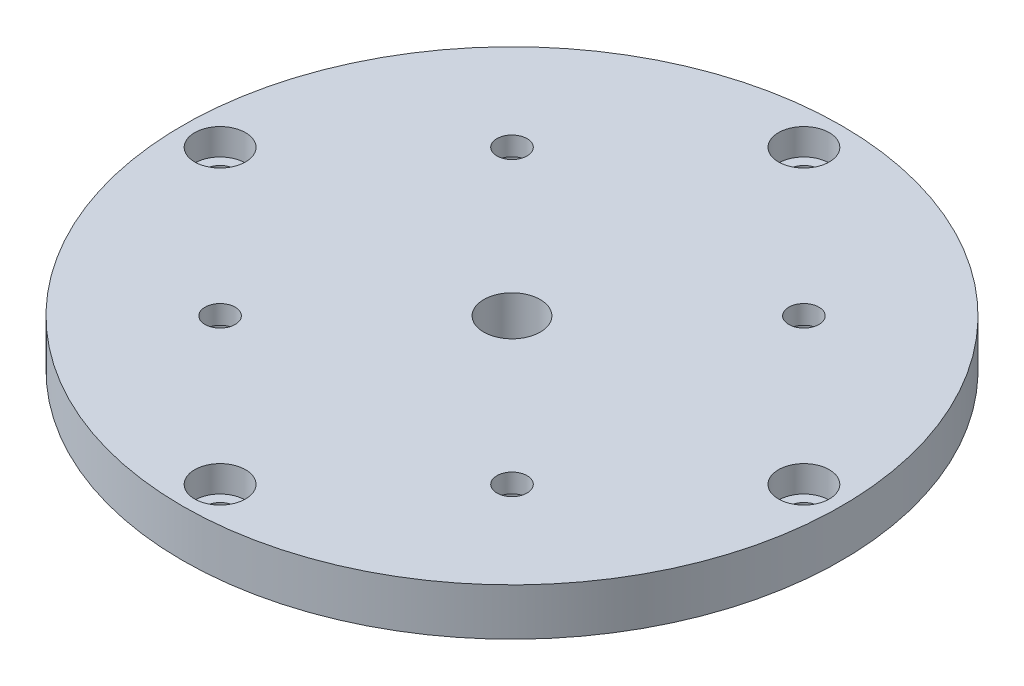
ISO-10303-21;
HEADER;
FILE_DESCRIPTION(('STEP AP214'),'2;1');
FILE_NAME('part.step','',(''),(''),'','','');
FILE_SCHEMA(('AUTOMOTIVE_DESIGN { 1 0 10303 214 1 1 1 1 }'));
ENDSEC;
DATA;
#1=APPLICATION_CONTEXT('core data for automotive mechanical design processes');
#2=APPLICATION_PROTOCOL_DEFINITION('international standard','automotive_design',2000,#1);
#3=PRODUCT_CONTEXT('',#1,'mechanical');
#4=PRODUCT('Part','Part','',(#3));
#5=PRODUCT_RELATED_PRODUCT_CATEGORY('part','',(#4));
#6=PRODUCT_DEFINITION_FORMATION('','',#4);
#7=PRODUCT_DEFINITION_CONTEXT('part definition',#1,'design');
#8=PRODUCT_DEFINITION('design','',#6,#7);
#9=PRODUCT_DEFINITION_SHAPE('','',#8);
#10=(LENGTH_UNIT() NAMED_UNIT(*) SI_UNIT(.MILLI.,.METRE.));
#11=(NAMED_UNIT(*) PLANE_ANGLE_UNIT() SI_UNIT($,.RADIAN.));
#12=(NAMED_UNIT(*) SI_UNIT($,.STERADIAN.) SOLID_ANGLE_UNIT());
#13=UNCERTAINTY_MEASURE_WITH_UNIT(LENGTH_MEASURE(1.E-05),#10,'distance_accuracy_value','');
#14=(GEOMETRIC_REPRESENTATION_CONTEXT(3) GLOBAL_UNCERTAINTY_ASSIGNED_CONTEXT((#13)) GLOBAL_UNIT_ASSIGNED_CONTEXT((#10,
#11,#12)) REPRESENTATION_CONTEXT('',''));
#15=CARTESIAN_POINT('',(0.,0.,0.));
#16=DIRECTION('',(0.,0.,1.));
#17=DIRECTION('',(1.,0.,0.));
#18=AXIS2_PLACEMENT_3D('',#15,#16,#17);
#19=CARTESIAN_POINT('',(1.75075676945298E-12,-5.,31.));
#20=DIRECTION('',(0.,1.,0.));
#21=DIRECTION('',(0.,0.,1.));
#22=AXIS2_PLACEMENT_3D('',#19,#20,#21);
#23=CYLINDRICAL_SURFACE('',#22,1.60000000000188);
#24=CARTESIAN_POINT('',(1.75075676945298E-12,0.,31.));
#25=DIRECTION('',(0.,1.,0.));
#26=DIRECTION('',(0.,0.,1.));
#27=AXIS2_PLACEMENT_3D('',#24,#25,#26);
#28=CIRCLE('',#27,1.60000000000188);
#29=CARTESIAN_POINT('',(1.75075676945298E-12,0.,32.6000000000019));
#30=VERTEX_POINT('',#29);
#31=EDGE_CURVE('E60',#30,#30,#28,.T.);
#32=ORIENTED_EDGE('',*,*,#31,.F.);
#33=EDGE_LOOP('',(#32));
#34=FACE_BOUND('',#33,.T.);
#35=CARTESIAN_POINT('',(1.75075676945298E-12,2.2,31.));
#36=DIRECTION('',(0.,1.,0.));
#37=DIRECTION('',(0.,0.,1.));
#38=AXIS2_PLACEMENT_3D('',#35,#36,#37);
#39=CIRCLE('',#38,1.60000000000188);
#40=CARTESIAN_POINT('',(1.75075676945298E-12,2.2,32.6000000000019));
#41=VERTEX_POINT('',#40);
#42=EDGE_CURVE('E45',#41,#41,#39,.F.);
#43=ORIENTED_EDGE('',*,*,#42,.F.);
#44=EDGE_LOOP('',(#43));
#45=FACE_BOUND('',#44,.T.);
#46=ADVANCED_FACE('F41',(#34,#45),#23,.F.);
#47=CARTESIAN_POINT('',(-30.9999999999991,-5.,8.79174789803846E-13));
#48=DIRECTION('',(0.,1.,0.));
#49=DIRECTION('',(0.,0.,1.));
#50=AXIS2_PLACEMENT_3D('',#47,#48,#49);
#51=CYLINDRICAL_SURFACE('',#50,1.60000000000141);
#52=CARTESIAN_POINT('',(-30.9999999999991,0.,8.79174789803846E-13));
#53=DIRECTION('',(0.,1.,0.));
#54=DIRECTION('',(0.,0.,1.));
#55=AXIS2_PLACEMENT_3D('',#52,#53,#54);
#56=CIRCLE('',#55,1.60000000000141);
#57=CARTESIAN_POINT('',(-30.9999999999991,0.,1.60000000000229));
#58=VERTEX_POINT('',#57);
#59=EDGE_CURVE('E63',#58,#58,#56,.T.);
#60=ORIENTED_EDGE('',*,*,#59,.F.);
#61=EDGE_LOOP('',(#60));
#62=FACE_BOUND('',#61,.T.);
#63=CARTESIAN_POINT('',(-30.9999999999991,2.2,8.79174789803846E-13));
#64=DIRECTION('',(0.,1.,0.));
#65=DIRECTION('',(0.,0.,1.));
#66=AXIS2_PLACEMENT_3D('',#63,#64,#65);
#67=CIRCLE('',#66,1.60000000000141);
#68=CARTESIAN_POINT('',(-30.9999999999991,2.2,1.60000000000229));
#69=VERTEX_POINT('',#68);
#70=EDGE_CURVE('E79',#69,#69,#67,.F.);
#71=ORIENTED_EDGE('',*,*,#70,.F.);
#72=EDGE_LOOP('',(#71));
#73=FACE_BOUND('',#72,.T.);
#74=ADVANCED_FACE('F89',(#62,#73),#51,.F.);
#75=CARTESIAN_POINT('',(31.0000000000009,-5.,-8.75378384726489E-13));
#76=DIRECTION('',(0.,1.,0.));
#77=DIRECTION('',(0.,0.,1.));
#78=AXIS2_PLACEMENT_3D('',#75,#76,#77);
#79=CYLINDRICAL_SURFACE('',#78,1.60000000000068);
#80=CARTESIAN_POINT('',(31.0000000000009,0.,-8.75378384726489E-13));
#81=DIRECTION('',(0.,1.,0.));
#82=DIRECTION('',(0.,0.,1.));
#83=AXIS2_PLACEMENT_3D('',#80,#81,#82);
#84=CIRCLE('',#83,1.60000000000068);
#85=CARTESIAN_POINT('',(31.0000000000009,0.,1.59999999999981));
#86=VERTEX_POINT('',#85);
#87=EDGE_CURVE('E66',#86,#86,#84,.T.);
#88=ORIENTED_EDGE('',*,*,#87,.F.);
#89=EDGE_LOOP('',(#88));
#90=FACE_BOUND('',#89,.T.);
#91=CARTESIAN_POINT('',(31.0000000000009,2.2,-8.75378384726489E-13));
#92=DIRECTION('',(0.,1.,0.));
#93=DIRECTION('',(0.,0.,1.));
#94=AXIS2_PLACEMENT_3D('',#91,#92,#93);
#95=CIRCLE('',#94,1.60000000000068);
#96=CARTESIAN_POINT('',(31.0000000000009,2.2,1.59999999999981));
#97=VERTEX_POINT('',#96);
#98=EDGE_CURVE('E76',#97,#97,#95,.F.);
#99=ORIENTED_EDGE('',*,*,#98,.F.);
#100=EDGE_LOOP('',(#99));
#101=FACE_BOUND('',#100,.T.);
#102=ADVANCED_FACE('F96',(#90,#101),#79,.F.);
#103=CARTESIAN_POINT('',(0.,-5.,-31.));
#104=DIRECTION('',(0.,1.,0.));
#105=DIRECTION('',(0.,0.,1.));
#106=AXIS2_PLACEMENT_3D('',#103,#104,#105);
#107=CYLINDRICAL_SURFACE('',#106,1.6);
#108=CARTESIAN_POINT('',(0.,0.,-31.));
#109=DIRECTION('',(0.,1.,0.));
#110=DIRECTION('',(0.,0.,1.));
#111=AXIS2_PLACEMENT_3D('',#108,#109,#110);
#112=CIRCLE('',#111,1.6);
#113=CARTESIAN_POINT('',(0.,0.,-29.4));
#114=VERTEX_POINT('',#113);
#115=EDGE_CURVE('E69',#114,#114,#112,.T.);
#116=ORIENTED_EDGE('',*,*,#115,.F.);
#117=EDGE_LOOP('',(#116));
#118=FACE_BOUND('',#117,.T.);
#119=CARTESIAN_POINT('',(0.,2.2,-31.));
#120=DIRECTION('',(0.,1.,0.));
#121=DIRECTION('',(0.,0.,1.));
#122=AXIS2_PLACEMENT_3D('',#119,#120,#121);
#123=CIRCLE('',#122,1.6);
#124=CARTESIAN_POINT('',(0.,2.2,-29.4));
#125=VERTEX_POINT('',#124);
#126=EDGE_CURVE('E73',#125,#125,#123,.F.);
#127=ORIENTED_EDGE('',*,*,#126,.F.);
#128=EDGE_LOOP('',(#127));
#129=FACE_BOUND('',#128,.T.);
#130=ADVANCED_FACE('F152',(#118,#129),#107,.F.);
#131=CARTESIAN_POINT('',(-15.5,5.,15.4999999999991));
#132=DIRECTION('',(0.,-1.,0.));
#133=DIRECTION('',(0.,0.,-1.));
#134=AXIS2_PLACEMENT_3D('',#131,#132,#133);
#135=CYLINDRICAL_SURFACE('',#134,1.60000000000094);
#136=CARTESIAN_POINT('',(-15.5,5.,15.4999999999991));
#137=DIRECTION('',(0.,-1.,0.));
#138=DIRECTION('',(0.,0.,-1.));
#139=AXIS2_PLACEMENT_3D('',#136,#137,#138);
#140=CIRCLE('',#139,1.60000000000094);
#141=CARTESIAN_POINT('',(-15.5,5.,13.8999999999982));
#142=VERTEX_POINT('',#141);
#143=EDGE_CURVE('E194',#142,#142,#140,.T.);
#144=ORIENTED_EDGE('',*,*,#143,.F.);
#145=EDGE_LOOP('',(#144));
#146=FACE_BOUND('',#145,.T.);
#147=CARTESIAN_POINT('',(-15.5,3.,15.4999999999991));
#148=DIRECTION('',(0.,-1.,0.));
#149=DIRECTION('',(0.,0.,-1.));
#150=AXIS2_PLACEMENT_3D('',#147,#148,#149);
#151=CIRCLE('',#150,1.60000000000094);
#152=CARTESIAN_POINT('',(-15.5,3.,13.8999999999982));
#153=VERTEX_POINT('',#152);
#154=EDGE_CURVE('E212',#153,#153,#151,.T.);
#155=ORIENTED_EDGE('',*,*,#154,.T.);
#156=EDGE_LOOP('',(#155));
#157=FACE_BOUND('',#156,.T.);
#158=ADVANCED_FACE('F140',(#146,#157),#135,.F.);
#159=CARTESIAN_POINT('',(15.5,5.,15.5));
#160=DIRECTION('',(0.,-1.,0.));
#161=DIRECTION('',(0.,0.,-1.));
#162=AXIS2_PLACEMENT_3D('',#159,#160,#161);
#163=CYLINDRICAL_SURFACE('',#162,1.6);
#164=CARTESIAN_POINT('',(15.5,5.,15.5));
#165=DIRECTION('',(0.,-1.,0.));
#166=DIRECTION('',(0.,0.,-1.));
#167=AXIS2_PLACEMENT_3D('',#164,#165,#166);
#168=CIRCLE('',#167,1.6);
#169=CARTESIAN_POINT('',(15.5,5.,13.9));
#170=VERTEX_POINT('',#169);
#171=EDGE_CURVE('E197',#170,#170,#168,.T.);
#172=ORIENTED_EDGE('',*,*,#171,.F.);
#173=EDGE_LOOP('',(#172));
#174=FACE_BOUND('',#173,.T.);
#175=CARTESIAN_POINT('',(15.5,3.,15.5));
#176=DIRECTION('',(0.,-1.,0.));
#177=DIRECTION('',(0.,0.,-1.));
#178=AXIS2_PLACEMENT_3D('',#175,#176,#177);
#179=CIRCLE('',#178,1.6);
#180=CARTESIAN_POINT('',(15.5,3.,13.9));
#181=VERTEX_POINT('',#180);
#182=EDGE_CURVE('E217',#181,#181,#179,.T.);
#183=ORIENTED_EDGE('',*,*,#182,.T.);
#184=EDGE_LOOP('',(#183));
#185=FACE_BOUND('',#184,.T.);
#186=ADVANCED_FACE('F136',(#174,#185),#163,.F.);
#187=CARTESIAN_POINT('',(15.5000000000009,5.,-15.5));
#188=DIRECTION('',(0.,-1.,0.));
#189=DIRECTION('',(0.,0.,-1.));
#190=AXIS2_PLACEMENT_3D('',#187,#188,#189);
#191=CYLINDRICAL_SURFACE('',#190,1.59999999999978);
#192=CARTESIAN_POINT('',(15.5000000000009,5.,-15.5));
#193=DIRECTION('',(0.,-1.,0.));
#194=DIRECTION('',(0.,0.,-1.));
#195=AXIS2_PLACEMENT_3D('',#192,#193,#194);
#196=CIRCLE('',#195,1.59999999999978);
#197=CARTESIAN_POINT('',(15.5000000000009,5.,-17.0999999999998));
#198=VERTEX_POINT('',#197);
#199=EDGE_CURVE('E202',#198,#198,#196,.T.);
#200=ORIENTED_EDGE('',*,*,#199,.F.);
#201=EDGE_LOOP('',(#200));
#202=FACE_BOUND('',#201,.T.);
#203=CARTESIAN_POINT('',(15.5000000000009,3.,-15.5));
#204=DIRECTION('',(0.,-1.,0.));
#205=DIRECTION('',(0.,0.,-1.));
#206=AXIS2_PLACEMENT_3D('',#203,#204,#205);
#207=CIRCLE('',#206,1.59999999999978);
#208=CARTESIAN_POINT('',(15.5000000000009,3.,-17.0999999999998));
#209=VERTEX_POINT('',#208);
#210=EDGE_CURVE('E225',#209,#209,#207,.T.);
#211=ORIENTED_EDGE('',*,*,#210,.T.);
#212=EDGE_LOOP('',(#211));
#213=FACE_BOUND('',#212,.T.);
#214=ADVANCED_FACE('F139',(#202,#213),#191,.F.);
#215=CARTESIAN_POINT('',(-15.4999999999991,5.,-15.5000000000009));
#216=DIRECTION('',(0.,-1.,0.));
#217=DIRECTION('',(0.,0.,-1.));
#218=AXIS2_PLACEMENT_3D('',#215,#216,#217);
#219=CYLINDRICAL_SURFACE('',#218,1.60000000000065);
#220=CARTESIAN_POINT('',(-15.4999999999991,5.,-15.5000000000009));
#221=DIRECTION('',(0.,-1.,0.));
#222=DIRECTION('',(0.,0.,-1.));
#223=AXIS2_PLACEMENT_3D('',#220,#221,#222);
#224=CIRCLE('',#223,1.60000000000065);
#225=CARTESIAN_POINT('',(-15.4999999999991,5.,-17.1000000000015));
#226=VERTEX_POINT('',#225);
#227=EDGE_CURVE('E205',#226,#226,#224,.T.);
#228=ORIENTED_EDGE('',*,*,#227,.F.);
#229=EDGE_LOOP('',(#228));
#230=FACE_BOUND('',#229,.T.);
#231=CARTESIAN_POINT('',(-15.4999999999991,3.,-15.5000000000009));
#232=DIRECTION('',(0.,-1.,0.));
#233=DIRECTION('',(0.,0.,-1.));
#234=AXIS2_PLACEMENT_3D('',#231,#232,#233);
#235=CIRCLE('',#234,1.60000000000065);
#236=CARTESIAN_POINT('',(-15.4999999999991,3.,-17.1000000000015));
#237=VERTEX_POINT('',#236);
#238=EDGE_CURVE('E218',#237,#237,#235,.T.);
#239=ORIENTED_EDGE('',*,*,#238,.T.);
#240=EDGE_LOOP('',(#239));
#241=FACE_BOUND('',#240,.T.);
#242=ADVANCED_FACE('F144',(#230,#241),#219,.F.);
#243=CARTESIAN_POINT('',(0.,5.,0.));
#244=DIRECTION('',(0.,1.,0.));
#245=DIRECTION('',(0.,0.,1.));
#246=AXIS2_PLACEMENT_3D('',#243,#244,#245);
#247=PLANE('',#246);
#248=CARTESIAN_POINT('',(0.,5.,-31.));
#249=DIRECTION('',(0.,1.,0.));
#250=DIRECTION('',(0.,0.,1.));
#251=AXIS2_PLACEMENT_3D('',#248,#249,#250);
#252=CIRCLE('',#251,2.7);
#253=CARTESIAN_POINT('',(0.,5.,-28.3));
#254=VERTEX_POINT('',#253);
#255=EDGE_CURVE('E255',#254,#254,#252,.T.);
#256=ORIENTED_EDGE('',*,*,#255,.F.);
#257=EDGE_LOOP('',(#256));
#258=FACE_BOUND('',#257,.T.);
#259=CARTESIAN_POINT('',(31.0000000000009,5.,-8.75378384726489E-13));
#260=DIRECTION('',(0.,1.,0.));
#261=DIRECTION('',(0.,0.,1.));
#262=AXIS2_PLACEMENT_3D('',#259,#260,#261);
#263=CIRCLE('',#262,2.70000000000069);
#264=CARTESIAN_POINT('',(31.0000000000009,5.,2.69999999999981));
#265=VERTEX_POINT('',#264);
#266=EDGE_CURVE('E252',#265,#265,#263,.T.);
#267=ORIENTED_EDGE('',*,*,#266,.F.);
#268=EDGE_LOOP('',(#267));
#269=FACE_BOUND('',#268,.T.);
#270=CARTESIAN_POINT('',(1.75075676945298E-12,5.,31.));
#271=DIRECTION('',(0.,1.,0.));
#272=DIRECTION('',(0.,0.,1.));
#273=AXIS2_PLACEMENT_3D('',#270,#271,#272);
#274=CIRCLE('',#273,2.70000000000188);
#275=CARTESIAN_POINT('',(1.75075676945298E-12,5.,33.7000000000019));
#276=VERTEX_POINT('',#275);
#277=EDGE_CURVE('E246',#276,#276,#274,.T.);
#278=ORIENTED_EDGE('',*,*,#277,.F.);
#279=EDGE_LOOP('',(#278));
#280=FACE_BOUND('',#279,.T.);
#281=CARTESIAN_POINT('',(-30.9999999999991,5.,8.79174789803846E-13));
#282=DIRECTION('',(0.,1.,0.));
#283=DIRECTION('',(0.,0.,1.));
#284=AXIS2_PLACEMENT_3D('',#281,#282,#283);
#285=CIRCLE('',#284,2.70000000000141);
#286=CARTESIAN_POINT('',(-30.9999999999991,5.,2.70000000000229));
#287=VERTEX_POINT('',#286);
#288=EDGE_CURVE('E240',#287,#287,#285,.T.);
#289=ORIENTED_EDGE('',*,*,#288,.F.);
#290=EDGE_LOOP('',(#289));
#291=FACE_BOUND('',#290,.T.);
#292=ORIENTED_EDGE('',*,*,#227,.T.);
#293=EDGE_LOOP('',(#292));
#294=FACE_BOUND('',#293,.T.);
#295=ORIENTED_EDGE('',*,*,#199,.T.);
#296=EDGE_LOOP('',(#295));
#297=FACE_BOUND('',#296,.T.);
#298=ORIENTED_EDGE('',*,*,#171,.T.);
#299=EDGE_LOOP('',(#298));
#300=FACE_BOUND('',#299,.T.);
#301=ORIENTED_EDGE('',*,*,#143,.T.);
#302=EDGE_LOOP('',(#301));
#303=FACE_BOUND('',#302,.T.);
#304=CARTESIAN_POINT('',(0.,5.,0.));
#305=DIRECTION('',(0.,1.,0.));
#306=DIRECTION('',(0.,0.,1.));
#307=AXIS2_PLACEMENT_3D('',#304,#305,#306);
#308=CIRCLE('',#307,35.);
#309=CARTESIAN_POINT('',(0.,5.,35.));
#310=VERTEX_POINT('',#309);
#311=EDGE_CURVE('E11',#310,#310,#308,.T.);
#312=ORIENTED_EDGE('',*,*,#311,.T.);
#313=EDGE_LOOP('',(#312));
#314=FACE_BOUND('',#313,.T.);
#315=CARTESIAN_POINT('',(0.,5.,0.));
#316=DIRECTION('',(0.,1.,0.));
#317=DIRECTION('',(0.,0.,1.));
#318=AXIS2_PLACEMENT_3D('',#315,#316,#317);
#319=CIRCLE('',#318,3.);
#320=CARTESIAN_POINT('',(0.,5.,3.));
#321=VERTEX_POINT('',#320);
#322=EDGE_CURVE('E54',#321,#321,#319,.T.);
#323=ORIENTED_EDGE('',*,*,#322,.F.);
#324=EDGE_LOOP('',(#323));
#325=FACE_BOUND('',#324,.T.);
#326=ADVANCED_FACE('F148',(#258,#269,#280,#291,#294,#297,#300,#303,#314,#325),#247,.T.);
#327=CARTESIAN_POINT('',(0.,0.,0.));
#328=DIRECTION('',(0.,1.,0.));
#329=DIRECTION('',(0.,0.,1.));
#330=AXIS2_PLACEMENT_3D('',#327,#328,#329);
#331=PLANE('',#330);
#332=ORIENTED_EDGE('',*,*,#115,.T.);
#333=EDGE_LOOP('',(#332));
#334=FACE_BOUND('',#333,.T.);
#335=ORIENTED_EDGE('',*,*,#87,.T.);
#336=EDGE_LOOP('',(#335));
#337=FACE_BOUND('',#336,.T.);
#338=ORIENTED_EDGE('',*,*,#59,.T.);
#339=EDGE_LOOP('',(#338));
#340=FACE_BOUND('',#339,.T.);
#341=ORIENTED_EDGE('',*,*,#31,.T.);
#342=EDGE_LOOP('',(#341));
#343=FACE_BOUND('',#342,.T.);
#344=CARTESIAN_POINT('',(-15.4999999999991,0.,-15.5000000000009));
#345=DIRECTION('',(0.,-1.,0.));
#346=DIRECTION('',(0.,0.,-1.));
#347=AXIS2_PLACEMENT_3D('',#344,#345,#346);
#348=CIRCLE('',#347,2.80000000000065);
#349=CARTESIAN_POINT('',(-15.4999999999991,0.,-18.3000000000015));
#350=VERTEX_POINT('',#349);
#351=EDGE_CURVE('E176',#350,#350,#348,.T.);
#352=ORIENTED_EDGE('',*,*,#351,.F.);
#353=EDGE_LOOP('',(#352));
#354=FACE_BOUND('',#353,.T.);
#355=CARTESIAN_POINT('',(15.5000000000009,0.,-15.5));
#356=DIRECTION('',(0.,-1.,0.));
#357=DIRECTION('',(0.,0.,-1.));
#358=AXIS2_PLACEMENT_3D('',#355,#356,#357);
#359=CIRCLE('',#358,2.79999999999978);
#360=CARTESIAN_POINT('',(15.5000000000009,0.,-18.2999999999998));
#361=VERTEX_POINT('',#360);
#362=EDGE_CURVE('E180',#361,#361,#359,.T.);
#363=ORIENTED_EDGE('',*,*,#362,.F.);
#364=EDGE_LOOP('',(#363));
#365=FACE_BOUND('',#364,.T.);
#366=CARTESIAN_POINT('',(15.5,0.,15.5));
#367=DIRECTION('',(0.,-1.,0.));
#368=DIRECTION('',(0.,0.,-1.));
#369=AXIS2_PLACEMENT_3D('',#366,#367,#368);
#370=CIRCLE('',#369,2.8);
#371=CARTESIAN_POINT('',(15.5,0.,12.7));
#372=VERTEX_POINT('',#371);
#373=EDGE_CURVE('E184',#372,#372,#370,.T.);
#374=ORIENTED_EDGE('',*,*,#373,.F.);
#375=EDGE_LOOP('',(#374));
#376=FACE_BOUND('',#375,.T.);
#377=CARTESIAN_POINT('',(-15.5,0.,15.4999999999991));
#378=DIRECTION('',(0.,-1.,0.));
#379=DIRECTION('',(0.,0.,-1.));
#380=AXIS2_PLACEMENT_3D('',#377,#378,#379);
#381=CIRCLE('',#380,2.80000000000094);
#382=CARTESIAN_POINT('',(-15.5,0.,12.6999999999982));
#383=VERTEX_POINT('',#382);
#384=EDGE_CURVE('E188',#383,#383,#381,.T.);
#385=ORIENTED_EDGE('',*,*,#384,.F.);
#386=EDGE_LOOP('',(#385));
#387=FACE_BOUND('',#386,.T.);
#388=CARTESIAN_POINT('',(0.,0.,0.));
#389=DIRECTION('',(0.,1.,0.));
#390=DIRECTION('',(0.,0.,1.));
#391=AXIS2_PLACEMENT_3D('',#388,#389,#390);
#392=CIRCLE('',#391,35.);
#393=CARTESIAN_POINT('',(0.,0.,35.));
#394=VERTEX_POINT('',#393);
#395=EDGE_CURVE('E49',#394,#394,#392,.T.);
#396=ORIENTED_EDGE('',*,*,#395,.F.);
#397=EDGE_LOOP('',(#396));
#398=FACE_BOUND('',#397,.T.);
#399=CARTESIAN_POINT('',(0.,0.,0.));
#400=DIRECTION('',(0.,1.,0.));
#401=DIRECTION('',(0.,0.,1.));
#402=AXIS2_PLACEMENT_3D('',#399,#400,#401);
#403=CIRCLE('',#402,3.);
#404=CARTESIAN_POINT('',(0.,0.,3.));
#405=VERTEX_POINT('',#404);
#406=EDGE_CURVE('E57',#405,#405,#403,.T.);
#407=ORIENTED_EDGE('',*,*,#406,.T.);
#408=EDGE_LOOP('',(#407));
#409=FACE_BOUND('',#408,.T.);
#410=ADVANCED_FACE('F158',(#334,#337,#340,#343,#354,#365,#376,#387,#398,#409),#331,.F.);
#411=CARTESIAN_POINT('',(0.,5.,0.));
#412=DIRECTION('',(0.,-1.,0.));
#413=DIRECTION('',(0.,0.,-1.));
#414=AXIS2_PLACEMENT_3D('',#411,#412,#413);
#415=CYLINDRICAL_SURFACE('',#414,35.);
#416=ORIENTED_EDGE('',*,*,#311,.F.);
#417=EDGE_LOOP('',(#416));
#418=FACE_BOUND('',#417,.T.);
#419=ORIENTED_EDGE('',*,*,#395,.T.);
#420=EDGE_LOOP('',(#419));
#421=FACE_BOUND('',#420,.T.);
#422=ADVANCED_FACE('F43',(#418,#421),#415,.T.);
#423=CARTESIAN_POINT('',(0.,5.,0.));
#424=DIRECTION('',(0.,-1.,0.));
#425=DIRECTION('',(0.,0.,-1.));
#426=AXIS2_PLACEMENT_3D('',#423,#424,#425);
#427=CYLINDRICAL_SURFACE('',#426,3.);
#428=ORIENTED_EDGE('',*,*,#322,.T.);
#429=EDGE_LOOP('',(#428));
#430=FACE_BOUND('',#429,.T.);
#431=ORIENTED_EDGE('',*,*,#406,.F.);
#432=EDGE_LOOP('',(#431));
#433=FACE_BOUND('',#432,.T.);
#434=ADVANCED_FACE('F123',(#430,#433),#427,.F.);
#435=CARTESIAN_POINT('',(-15.4999999999991,3.,-15.5000000000009));
#436=DIRECTION('',(0.,-1.,0.));
#437=DIRECTION('',(0.,0.,-1.));
#438=AXIS2_PLACEMENT_3D('',#435,#436,#437);
#439=CYLINDRICAL_SURFACE('',#438,2.80000000000065);
#440=CARTESIAN_POINT('',(-15.4999999999991,3.,-15.5000000000009));
#441=DIRECTION('',(0.,-1.,0.));
#442=DIRECTION('',(0.,0.,-1.));
#443=AXIS2_PLACEMENT_3D('',#440,#441,#442);
#444=CIRCLE('',#443,2.80000000000065);
#445=CARTESIAN_POINT('',(-15.4999999999991,3.,-18.3000000000015));
#446=VERTEX_POINT('',#445);
#447=EDGE_CURVE('E72',#446,#446,#444,.T.);
#448=ORIENTED_EDGE('',*,*,#447,.F.);
#449=EDGE_LOOP('',(#448));
#450=FACE_BOUND('',#449,.T.);
#451=ORIENTED_EDGE('',*,*,#351,.T.);
#452=EDGE_LOOP('',(#451));
#453=FACE_BOUND('',#452,.T.);
#454=ADVANCED_FACE('F120',(#450,#453),#439,.F.);
#455=CARTESIAN_POINT('',(-15.4999999999991,3.,-15.5000000000009));
#456=DIRECTION('',(0.,-1.,0.));
#457=DIRECTION('',(0.,0.,-1.));
#458=AXIS2_PLACEMENT_3D('',#455,#456,#457);
#459=PLANE('',#458);
#460=ORIENTED_EDGE('',*,*,#238,.F.);
#461=EDGE_LOOP('',(#460));
#462=FACE_BOUND('',#461,.T.);
#463=ORIENTED_EDGE('',*,*,#447,.T.);
#464=EDGE_LOOP('',(#463));
#465=FACE_BOUND('',#464,.T.);
#466=ADVANCED_FACE('F115',(#462,#465),#459,.T.);
#467=CARTESIAN_POINT('',(15.5000000000009,3.,-15.5));
#468=DIRECTION('',(0.,-1.,0.));
#469=DIRECTION('',(0.,0.,-1.));
#470=AXIS2_PLACEMENT_3D('',#467,#468,#469);
#471=CYLINDRICAL_SURFACE('',#470,2.79999999999978);
#472=CARTESIAN_POINT('',(15.5000000000009,3.,-15.5));
#473=DIRECTION('',(0.,-1.,0.));
#474=DIRECTION('',(0.,0.,-1.));
#475=AXIS2_PLACEMENT_3D('',#472,#473,#474);
#476=CIRCLE('',#475,2.79999999999978);
#477=CARTESIAN_POINT('',(15.5000000000009,3.,-18.2999999999998));
#478=VERTEX_POINT('',#477);
#479=EDGE_CURVE('E221',#478,#478,#476,.T.);
#480=ORIENTED_EDGE('',*,*,#479,.F.);
#481=EDGE_LOOP('',(#480));
#482=FACE_BOUND('',#481,.T.);
#483=ORIENTED_EDGE('',*,*,#362,.T.);
#484=EDGE_LOOP('',(#483));
#485=FACE_BOUND('',#484,.T.);
#486=ADVANCED_FACE('F112',(#482,#485),#471,.F.);
#487=CARTESIAN_POINT('',(15.5000000000009,3.,-15.5));
#488=DIRECTION('',(0.,-1.,0.));
#489=DIRECTION('',(0.,0.,-1.));
#490=AXIS2_PLACEMENT_3D('',#487,#488,#489);
#491=PLANE('',#490);
#492=ORIENTED_EDGE('',*,*,#210,.F.);
#493=EDGE_LOOP('',(#492));
#494=FACE_BOUND('',#493,.T.);
#495=ORIENTED_EDGE('',*,*,#479,.T.);
#496=EDGE_LOOP('',(#495));
#497=FACE_BOUND('',#496,.T.);
#498=ADVANCED_FACE('F106',(#494,#497),#491,.T.);
#499=CARTESIAN_POINT('',(15.5,3.,15.5));
#500=DIRECTION('',(0.,-1.,0.));
#501=DIRECTION('',(0.,0.,-1.));
#502=AXIS2_PLACEMENT_3D('',#499,#500,#501);
#503=CYLINDRICAL_SURFACE('',#502,2.8);
#504=CARTESIAN_POINT('',(15.5,3.,15.5));
#505=DIRECTION('',(0.,-1.,0.));
#506=DIRECTION('',(0.,0.,-1.));
#507=AXIS2_PLACEMENT_3D('',#504,#505,#506);
#508=CIRCLE('',#507,2.8);
#509=CARTESIAN_POINT('',(15.5,3.,12.7));
#510=VERTEX_POINT('',#509);
#511=EDGE_CURVE('E228',#510,#510,#508,.T.);
#512=ORIENTED_EDGE('',*,*,#511,.F.);
#513=EDGE_LOOP('',(#512));
#514=FACE_BOUND('',#513,.T.);
#515=ORIENTED_EDGE('',*,*,#373,.T.);
#516=EDGE_LOOP('',(#515));
#517=FACE_BOUND('',#516,.T.);
#518=ADVANCED_FACE('F102',(#514,#517),#503,.F.);
#519=CARTESIAN_POINT('',(15.5,3.,15.5));
#520=DIRECTION('',(0.,-1.,0.));
#521=DIRECTION('',(0.,0.,-1.));
#522=AXIS2_PLACEMENT_3D('',#519,#520,#521);
#523=PLANE('',#522);
#524=ORIENTED_EDGE('',*,*,#182,.F.);
#525=EDGE_LOOP('',(#524));
#526=FACE_BOUND('',#525,.T.);
#527=ORIENTED_EDGE('',*,*,#511,.T.);
#528=EDGE_LOOP('',(#527));
#529=FACE_BOUND('',#528,.T.);
#530=ADVANCED_FACE('F105',(#526,#529),#523,.T.);
#531=CARTESIAN_POINT('',(-15.5,3.,15.4999999999991));
#532=DIRECTION('',(0.,-1.,0.));
#533=DIRECTION('',(0.,0.,-1.));
#534=AXIS2_PLACEMENT_3D('',#531,#532,#533);
#535=CYLINDRICAL_SURFACE('',#534,2.80000000000094);
#536=CARTESIAN_POINT('',(-15.5,3.,15.4999999999991));
#537=DIRECTION('',(0.,-1.,0.));
#538=DIRECTION('',(0.,0.,-1.));
#539=AXIS2_PLACEMENT_3D('',#536,#537,#538);
#540=CIRCLE('',#539,2.80000000000094);
#541=CARTESIAN_POINT('',(-15.5,3.,12.6999999999982));
#542=VERTEX_POINT('',#541);
#543=EDGE_CURVE('E208',#542,#542,#540,.T.);
#544=ORIENTED_EDGE('',*,*,#543,.F.);
#545=EDGE_LOOP('',(#544));
#546=FACE_BOUND('',#545,.T.);
#547=ORIENTED_EDGE('',*,*,#384,.T.);
#548=EDGE_LOOP('',(#547));
#549=FACE_BOUND('',#548,.T.);
#550=ADVANCED_FACE('F110',(#546,#549),#535,.F.);
#551=CARTESIAN_POINT('',(-15.5,3.,15.4999999999991));
#552=DIRECTION('',(0.,-1.,0.));
#553=DIRECTION('',(0.,0.,-1.));
#554=AXIS2_PLACEMENT_3D('',#551,#552,#553);
#555=PLANE('',#554);
#556=ORIENTED_EDGE('',*,*,#154,.F.);
#557=EDGE_LOOP('',(#556));
#558=FACE_BOUND('',#557,.T.);
#559=ORIENTED_EDGE('',*,*,#543,.T.);
#560=EDGE_LOOP('',(#559));
#561=FACE_BOUND('',#560,.T.);
#562=ADVANCED_FACE('F128',(#558,#561),#555,.T.);
#563=CARTESIAN_POINT('',(0.,2.2,-31.));
#564=DIRECTION('',(0.,1.,0.));
#565=DIRECTION('',(0.,0.,1.));
#566=AXIS2_PLACEMENT_3D('',#563,#564,#565);
#567=PLANE('',#566);
#568=CARTESIAN_POINT('',(0.,2.2,-31.));
#569=DIRECTION('',(0.,1.,0.));
#570=DIRECTION('',(0.,0.,1.));
#571=AXIS2_PLACEMENT_3D('',#568,#569,#570);
#572=CIRCLE('',#571,2.7);
#573=CARTESIAN_POINT('',(0.,2.2,-28.3));
#574=VERTEX_POINT('',#573);
#575=EDGE_CURVE('E77',#574,#574,#572,.T.);
#576=ORIENTED_EDGE('',*,*,#575,.T.);
#577=EDGE_LOOP('',(#576));
#578=FACE_BOUND('',#577,.T.);
#579=ORIENTED_EDGE('',*,*,#126,.T.);
#580=EDGE_LOOP('',(#579));
#581=FACE_BOUND('',#580,.T.);
#582=ADVANCED_FACE('F131',(#578,#581),#567,.T.);
#583=CARTESIAN_POINT('',(0.,2.2,-31.));
#584=DIRECTION('',(0.,1.,0.));
#585=DIRECTION('',(0.,0.,1.));
#586=AXIS2_PLACEMENT_3D('',#583,#584,#585);
#587=CYLINDRICAL_SURFACE('',#586,2.7);
#588=ORIENTED_EDGE('',*,*,#575,.F.);
#589=EDGE_LOOP('',(#588));
#590=FACE_BOUND('',#589,.T.);
#591=ORIENTED_EDGE('',*,*,#255,.T.);
#592=EDGE_LOOP('',(#591));
#593=FACE_BOUND('',#592,.T.);
#594=ADVANCED_FACE('F263',(#590,#593),#587,.F.);
#595=CARTESIAN_POINT('',(31.0000000000009,2.2,-8.75378384726489E-13));
#596=DIRECTION('',(0.,1.,0.));
#597=DIRECTION('',(0.,0.,1.));
#598=AXIS2_PLACEMENT_3D('',#595,#596,#597);
#599=PLANE('',#598);
#600=CARTESIAN_POINT('',(31.0000000000009,2.2,-8.75378384726489E-13));
#601=DIRECTION('',(0.,1.,0.));
#602=DIRECTION('',(0.,0.,1.));
#603=AXIS2_PLACEMENT_3D('',#600,#601,#602);
#604=CIRCLE('',#603,2.70000000000069);
#605=CARTESIAN_POINT('',(31.0000000000009,2.2,2.69999999999981));
#606=VERTEX_POINT('',#605);
#607=EDGE_CURVE('E249',#606,#606,#604,.T.);
#608=ORIENTED_EDGE('',*,*,#607,.T.);
#609=EDGE_LOOP('',(#608));
#610=FACE_BOUND('',#609,.T.);
#611=ORIENTED_EDGE('',*,*,#98,.T.);
#612=EDGE_LOOP('',(#611));
#613=FACE_BOUND('',#612,.T.);
#614=ADVANCED_FACE('F266',(#610,#613),#599,.T.);
#615=CARTESIAN_POINT('',(31.0000000000009,2.2,-8.75378384726489E-13));
#616=DIRECTION('',(0.,1.,0.));
#617=DIRECTION('',(0.,0.,1.));
#618=AXIS2_PLACEMENT_3D('',#615,#616,#617);
#619=CYLINDRICAL_SURFACE('',#618,2.70000000000069);
#620=ORIENTED_EDGE('',*,*,#607,.F.);
#621=EDGE_LOOP('',(#620));
#622=FACE_BOUND('',#621,.T.);
#623=ORIENTED_EDGE('',*,*,#266,.T.);
#624=EDGE_LOOP('',(#623));
#625=FACE_BOUND('',#624,.T.);
#626=ADVANCED_FACE('F311',(#622,#625),#619,.F.);
#627=CARTESIAN_POINT('',(-30.9999999999991,2.2,8.79174789803846E-13));
#628=DIRECTION('',(0.,1.,0.));
#629=DIRECTION('',(0.,0.,1.));
#630=AXIS2_PLACEMENT_3D('',#627,#628,#629);
#631=PLANE('',#630);
#632=CARTESIAN_POINT('',(-30.9999999999991,2.2,8.79174789803846E-13));
#633=DIRECTION('',(0.,1.,0.));
#634=DIRECTION('',(0.,0.,1.));
#635=AXIS2_PLACEMENT_3D('',#632,#633,#634);
#636=CIRCLE('',#635,2.70000000000141);
#637=CARTESIAN_POINT('',(-30.9999999999991,2.2,2.70000000000229));
#638=VERTEX_POINT('',#637);
#639=EDGE_CURVE('E237',#638,#638,#636,.T.);
#640=ORIENTED_EDGE('',*,*,#639,.T.);
#641=EDGE_LOOP('',(#640));
#642=FACE_BOUND('',#641,.T.);
#643=ORIENTED_EDGE('',*,*,#70,.T.);
#644=EDGE_LOOP('',(#643));
#645=FACE_BOUND('',#644,.T.);
#646=ADVANCED_FACE('F301',(#642,#645),#631,.T.);
#647=CARTESIAN_POINT('',(-30.9999999999991,2.2,8.79174789803846E-13));
#648=DIRECTION('',(0.,1.,0.));
#649=DIRECTION('',(0.,0.,1.));
#650=AXIS2_PLACEMENT_3D('',#647,#648,#649);
#651=CYLINDRICAL_SURFACE('',#650,2.70000000000141);
#652=ORIENTED_EDGE('',*,*,#639,.F.);
#653=EDGE_LOOP('',(#652));
#654=FACE_BOUND('',#653,.T.);
#655=ORIENTED_EDGE('',*,*,#288,.T.);
#656=EDGE_LOOP('',(#655));
#657=FACE_BOUND('',#656,.T.);
#658=ADVANCED_FACE('F299',(#654,#657),#651,.F.);
#659=CARTESIAN_POINT('',(1.75075676945298E-12,2.2,31.));
#660=DIRECTION('',(0.,1.,0.));
#661=DIRECTION('',(0.,0.,1.));
#662=AXIS2_PLACEMENT_3D('',#659,#660,#661);
#663=PLANE('',#662);
#664=CARTESIAN_POINT('',(1.75075676945298E-12,2.2,31.));
#665=DIRECTION('',(0.,1.,0.));
#666=DIRECTION('',(0.,0.,1.));
#667=AXIS2_PLACEMENT_3D('',#664,#665,#666);
#668=CIRCLE('',#667,2.70000000000188);
#669=CARTESIAN_POINT('',(1.75075676945298E-12,2.2,33.7000000000019));
#670=VERTEX_POINT('',#669);
#671=EDGE_CURVE('E243',#670,#670,#668,.T.);
#672=ORIENTED_EDGE('',*,*,#671,.T.);
#673=EDGE_LOOP('',(#672));
#674=FACE_BOUND('',#673,.T.);
#675=ORIENTED_EDGE('',*,*,#42,.T.);
#676=EDGE_LOOP('',(#675));
#677=FACE_BOUND('',#676,.T.);
#678=ADVANCED_FACE('F86',(#674,#677),#663,.T.);
#679=CARTESIAN_POINT('',(1.75075676945298E-12,2.2,31.));
#680=DIRECTION('',(0.,1.,0.));
#681=DIRECTION('',(0.,0.,1.));
#682=AXIS2_PLACEMENT_3D('',#679,#680,#681);
#683=CYLINDRICAL_SURFACE('',#682,2.70000000000188);
#684=ORIENTED_EDGE('',*,*,#671,.F.);
#685=EDGE_LOOP('',(#684));
#686=FACE_BOUND('',#685,.T.);
#687=ORIENTED_EDGE('',*,*,#277,.T.);
#688=EDGE_LOOP('',(#687));
#689=FACE_BOUND('',#688,.T.);
#690=ADVANCED_FACE('F308',(#686,#689),#683,.F.);
#691=CLOSED_SHELL('',(#46,#74,#102,#130,#158,#186,#214,#242,#326,#410,#422,#434,#454,#466,#486,
#498,#518,#530,#550,#562,#582,#594,#614,#626,#646,#658,#678,#690));
#692=MANIFOLD_SOLID_BREP('B2',#691);
#693=ADVANCED_BREP_SHAPE_REPRESENTATION('',(#18,#692),#14);
#694=SHAPE_DEFINITION_REPRESENTATION(#9,#693);
ENDSEC;
END-ISO-10303-21;
